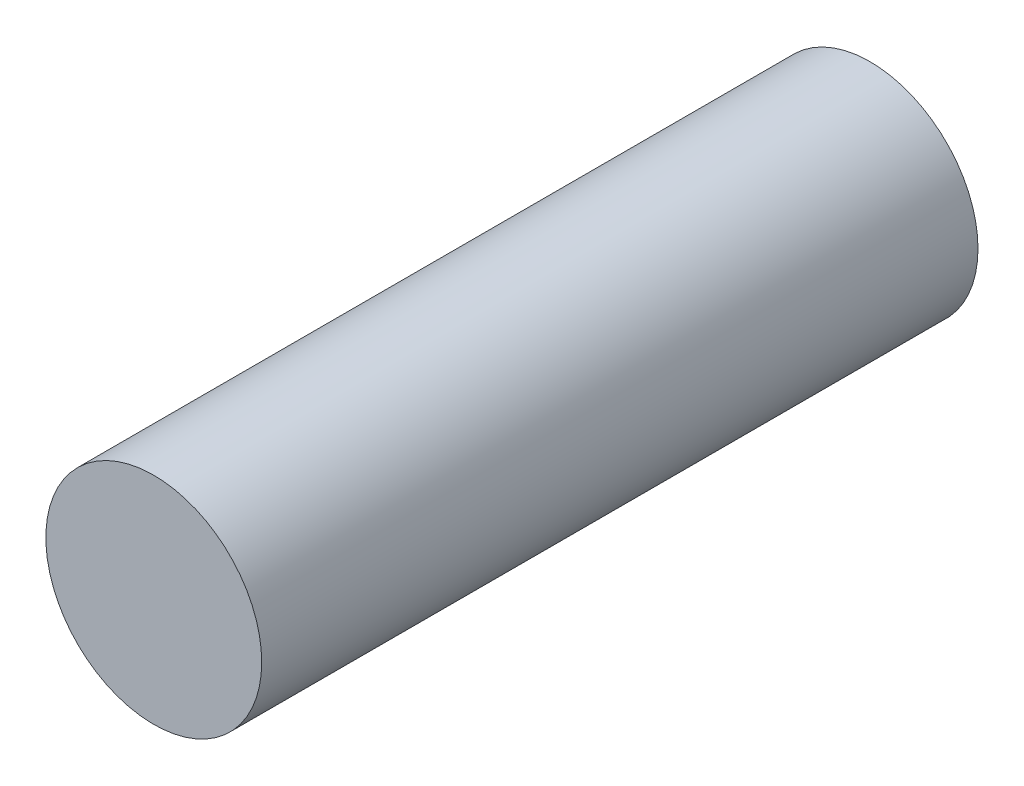
ISO-10303-21;
HEADER;
FILE_DESCRIPTION(('STEP AP214'),'2;1');
FILE_NAME('part.step','',(''),(''),'','','');
FILE_SCHEMA(('AUTOMOTIVE_DESIGN { 1 0 10303 214 1 1 1 1 }'));
ENDSEC;
DATA;
#1=APPLICATION_CONTEXT('core data for automotive mechanical design processes');
#2=APPLICATION_PROTOCOL_DEFINITION('international standard','automotive_design',2000,#1);
#3=PRODUCT_CONTEXT('',#1,'mechanical');
#4=PRODUCT('Part','Part','',(#3));
#5=PRODUCT_RELATED_PRODUCT_CATEGORY('part','',(#4));
#6=PRODUCT_DEFINITION_FORMATION('','',#4);
#7=PRODUCT_DEFINITION_CONTEXT('part definition',#1,'design');
#8=PRODUCT_DEFINITION('design','',#6,#7);
#9=PRODUCT_DEFINITION_SHAPE('','',#8);
#10=(LENGTH_UNIT() NAMED_UNIT(*) SI_UNIT(.MILLI.,.METRE.));
#11=(NAMED_UNIT(*) PLANE_ANGLE_UNIT() SI_UNIT($,.RADIAN.));
#12=(NAMED_UNIT(*) SI_UNIT($,.STERADIAN.) SOLID_ANGLE_UNIT());
#13=UNCERTAINTY_MEASURE_WITH_UNIT(LENGTH_MEASURE(1.E-05),#10,'distance_accuracy_value','');
#14=(GEOMETRIC_REPRESENTATION_CONTEXT(3) GLOBAL_UNCERTAINTY_ASSIGNED_CONTEXT((#13)) GLOBAL_UNIT_ASSIGNED_CONTEXT((#10,
#11,#12)) REPRESENTATION_CONTEXT('',''));
#15=CARTESIAN_POINT('',(0.,0.,0.));
#16=DIRECTION('',(0.,0.,1.));
#17=DIRECTION('',(1.,0.,0.));
#18=AXIS2_PLACEMENT_3D('',#15,#16,#17);
#19=CARTESIAN_POINT('',(0.,0.,73.));
#20=DIRECTION('',(0.,0.,-1.));
#21=DIRECTION('',(-1.,0.,0.));
#22=AXIS2_PLACEMENT_3D('',#19,#20,#21);
#23=CYLINDRICAL_SURFACE('',#22,11.);
#24=CARTESIAN_POINT('',(0.,0.,73.));
#25=DIRECTION('',(0.,0.,1.));
#26=DIRECTION('',(1.,0.,0.));
#27=AXIS2_PLACEMENT_3D('',#24,#25,#26);
#28=CIRCLE('',#27,11.);
#29=CARTESIAN_POINT('',(11.,0.,73.));
#30=VERTEX_POINT('',#29);
#31=EDGE_CURVE('E10',#30,#30,#28,.T.);
#32=ORIENTED_EDGE('',*,*,#31,.F.);
#33=EDGE_LOOP('',(#32));
#34=FACE_BOUND('',#33,.T.);
#35=CARTESIAN_POINT('',(0.,0.,0.));
#36=DIRECTION('',(0.,0.,1.));
#37=DIRECTION('',(1.,0.,0.));
#38=AXIS2_PLACEMENT_3D('',#35,#36,#37);
#39=CIRCLE('',#38,11.);
#40=CARTESIAN_POINT('',(11.,0.,0.));
#41=VERTEX_POINT('',#40);
#42=EDGE_CURVE('E46',#41,#41,#39,.T.);
#43=ORIENTED_EDGE('',*,*,#42,.T.);
#44=EDGE_LOOP('',(#43));
#45=FACE_BOUND('',#44,.T.);
#46=ADVANCED_FACE('F43',(#34,#45),#23,.T.);
#47=CARTESIAN_POINT('',(0.,0.,73.));
#48=DIRECTION('',(0.,0.,1.));
#49=DIRECTION('',(1.,0.,0.));
#50=AXIS2_PLACEMENT_3D('',#47,#48,#49);
#51=PLANE('',#50);
#52=ORIENTED_EDGE('',*,*,#31,.T.);
#53=EDGE_LOOP('',(#52));
#54=FACE_BOUND('',#53,.T.);
#55=ADVANCED_FACE('F60',(#54),#51,.T.);
#56=CARTESIAN_POINT('',(0.,0.,0.));
#57=DIRECTION('',(0.,0.,1.));
#58=DIRECTION('',(1.,0.,0.));
#59=AXIS2_PLACEMENT_3D('',#56,#57,#58);
#60=PLANE('',#59);
#61=ORIENTED_EDGE('',*,*,#42,.F.);
#62=EDGE_LOOP('',(#61));
#63=FACE_BOUND('',#62,.T.);
#64=ADVANCED_FACE('F58',(#63),#60,.F.);
#65=CLOSED_SHELL('',(#46,#55,#64));
#66=MANIFOLD_SOLID_BREP('B2',#65);
#67=ADVANCED_BREP_SHAPE_REPRESENTATION('',(#18,#66),#14);
#68=SHAPE_DEFINITION_REPRESENTATION(#9,#67);
ENDSEC;
END-ISO-10303-21;
